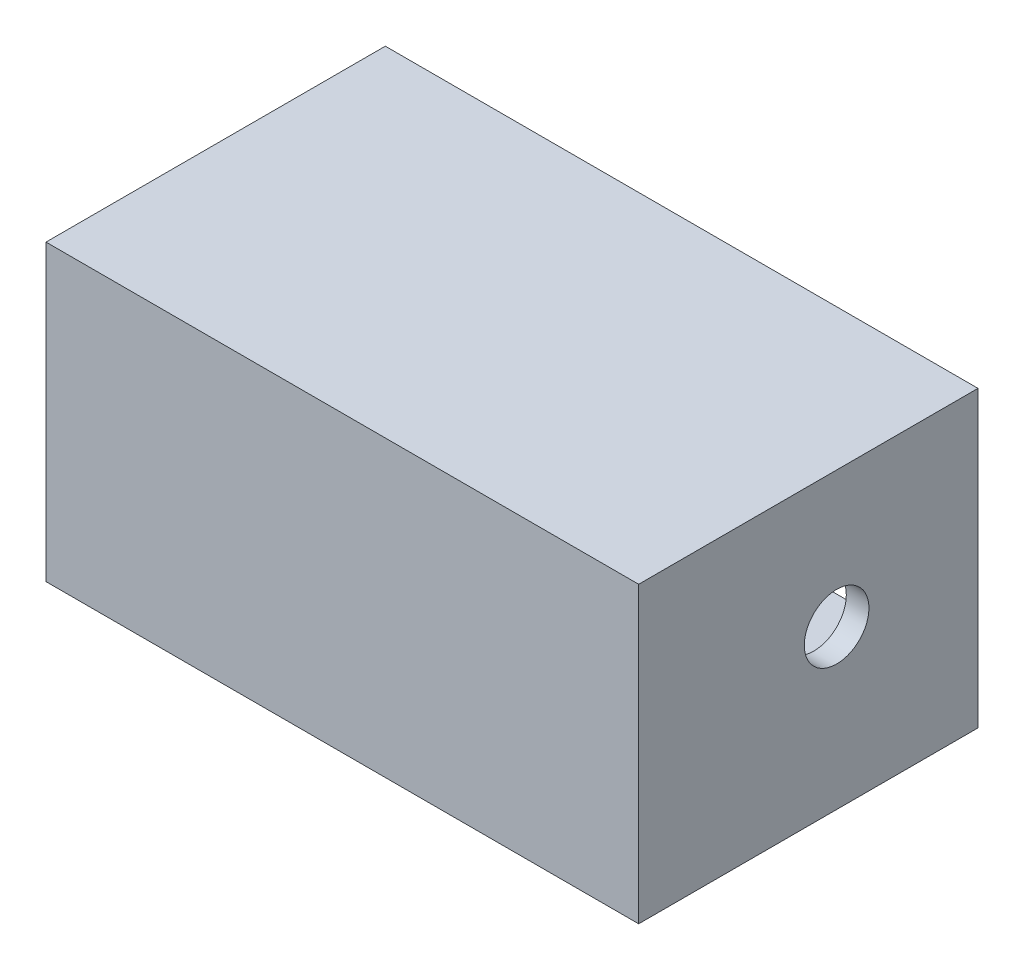
ISO-10303-21;
HEADER;
FILE_DESCRIPTION(('STEP AP214'),'2;1');
FILE_NAME('part.step','',(''),(''),'','','');
FILE_SCHEMA(('AUTOMOTIVE_DESIGN { 1 0 10303 214 1 1 1 1 }'));
ENDSEC;
DATA;
#1=APPLICATION_CONTEXT('core data for automotive mechanical design processes');
#2=APPLICATION_PROTOCOL_DEFINITION('international standard','automotive_design',2000,#1);
#3=PRODUCT_CONTEXT('',#1,'mechanical');
#4=PRODUCT('Part','Part','',(#3));
#5=PRODUCT_RELATED_PRODUCT_CATEGORY('part','',(#4));
#6=PRODUCT_DEFINITION_FORMATION('','',#4);
#7=PRODUCT_DEFINITION_CONTEXT('part definition',#1,'design');
#8=PRODUCT_DEFINITION('design','',#6,#7);
#9=PRODUCT_DEFINITION_SHAPE('','',#8);
#10=(LENGTH_UNIT() NAMED_UNIT(*) SI_UNIT(.MILLI.,.METRE.));
#11=(NAMED_UNIT(*) PLANE_ANGLE_UNIT() SI_UNIT($,.RADIAN.));
#12=(NAMED_UNIT(*) SI_UNIT($,.STERADIAN.) SOLID_ANGLE_UNIT());
#13=UNCERTAINTY_MEASURE_WITH_UNIT(LENGTH_MEASURE(1.E-05),#10,'distance_accuracy_value','');
#14=(GEOMETRIC_REPRESENTATION_CONTEXT(3) GLOBAL_UNCERTAINTY_ASSIGNED_CONTEXT((#13)) GLOBAL_UNIT_ASSIGNED_CONTEXT((#10,
#11,#12)) REPRESENTATION_CONTEXT('',''));
#15=CARTESIAN_POINT('',(0.,0.,0.));
#16=DIRECTION('',(0.,0.,1.));
#17=DIRECTION('',(1.,0.,0.));
#18=AXIS2_PLACEMENT_3D('',#15,#16,#17);
#19=CARTESIAN_POINT('',(0.,20.,0.));
#20=DIRECTION('',(0.,-1.,0.));
#21=DIRECTION('',(0.,0.,-1.));
#22=AXIS2_PLACEMENT_3D('',#19,#20,#21);
#23=PLANE('',#22);
#24=DIRECTION('',(0.,0.,-1.));
#25=VECTOR('',#24,1.);
#26=CARTESIAN_POINT('',(10.,20.,-10.));
#27=LINE('',#26,#25);
#28=CARTESIAN_POINT('',(10.,20.,-10.));
#29=VERTEX_POINT('',#28);
#30=CARTESIAN_POINT('',(10.,20.,-150.));
#31=VERTEX_POINT('',#30);
#32=EDGE_CURVE('E61',#29,#31,#27,.T.);
#33=ORIENTED_EDGE('',*,*,#32,.F.);
#34=DIRECTION('',(-1.,0.,0.));
#35=VECTOR('',#34,1.);
#36=CARTESIAN_POINT('',(10.,20.,-10.));
#37=LINE('',#36,#35);
#38=CARTESIAN_POINT('',(252.,20.,-10.));
#39=VERTEX_POINT('',#38);
#40=EDGE_CURVE('E174',#39,#29,#37,.T.);
#41=ORIENTED_EDGE('',*,*,#40,.F.);
#42=DIRECTION('',(0.,0.,1.));
#43=VECTOR('',#42,1.);
#44=CARTESIAN_POINT('',(252.,20.,-150.));
#45=LINE('',#44,#43);
#46=CARTESIAN_POINT('',(252.,20.,-150.));
#47=VERTEX_POINT('',#46);
#48=EDGE_CURVE('E154',#47,#39,#45,.T.);
#49=ORIENTED_EDGE('',*,*,#48,.F.);
#50=DIRECTION('',(-1.,0.,0.));
#51=VECTOR('',#50,1.);
#52=CARTESIAN_POINT('',(0.,20.,-150.));
#53=LINE('',#52,#51);
#54=EDGE_CURVE('E66',#47,#31,#53,.T.);
#55=ORIENTED_EDGE('',*,*,#54,.T.);
#56=EDGE_LOOP('',(#33,#41,#49,#55));
#57=FACE_BOUND('',#56,.T.);
#58=ADVANCED_FACE('F45',(#57),#23,.F.);
#59=CARTESIAN_POINT('',(0.,20.,0.));
#60=DIRECTION('',(1.,0.,0.));
#61=DIRECTION('',(0.,0.,-1.));
#62=AXIS2_PLACEMENT_3D('',#59,#60,#61);
#63=PLANE('',#62);
#64=CARTESIAN_POINT('',(0.,70.,-87.5));
#65=DIRECTION('',(1.,0.,0.));
#66=DIRECTION('',(0.,0.,-1.));
#67=AXIS2_PLACEMENT_3D('',#64,#65,#66);
#68=CIRCLE('',#67,14.2875);
#69=CARTESIAN_POINT('',(0.,70.,-101.7875));
#70=VERTEX_POINT('',#69);
#71=EDGE_CURVE('E150',#70,#70,#68,.T.);
#72=ORIENTED_EDGE('',*,*,#71,.T.);
#73=EDGE_LOOP('',(#72));
#74=FACE_BOUND('',#73,.T.);
#75=DIRECTION('',(0.,0.,1.));
#76=VECTOR('',#75,1.);
#77=CARTESIAN_POINT('',(0.,0.,0.));
#78=LINE('',#77,#76);
#79=CARTESIAN_POINT('',(0.,0.,-150.));
#80=VERTEX_POINT('',#79);
#81=CARTESIAN_POINT('',(0.,0.,0.));
#82=VERTEX_POINT('',#81);
#83=EDGE_CURVE('E114',#80,#82,#78,.T.);
#84=ORIENTED_EDGE('',*,*,#83,.T.);
#85=DIRECTION('',(0.,-1.,0.));
#86=VECTOR('',#85,1.);
#87=CARTESIAN_POINT('',(0.,20.,0.));
#88=LINE('',#87,#86);
#89=CARTESIAN_POINT('',(0.,130.,0.));
#90=VERTEX_POINT('',#89);
#91=EDGE_CURVE('E11',#90,#82,#88,.T.);
#92=ORIENTED_EDGE('',*,*,#91,.F.);
#93=DIRECTION('',(0.,0.,1.));
#94=VECTOR('',#93,1.);
#95=CARTESIAN_POINT('',(0.,130.,0.));
#96=LINE('',#95,#94);
#97=CARTESIAN_POINT('',(0.,130.,-150.));
#98=VERTEX_POINT('',#97);
#99=EDGE_CURVE('E112',#98,#90,#96,.T.);
#100=ORIENTED_EDGE('',*,*,#99,.F.);
#101=DIRECTION('',(0.,-1.,0.));
#102=VECTOR('',#101,1.);
#103=CARTESIAN_POINT('',(0.,20.,-150.));
#104=LINE('',#103,#102);
#105=EDGE_CURVE('E196',#98,#80,#104,.T.);
#106=ORIENTED_EDGE('',*,*,#105,.T.);
#107=EDGE_LOOP('',(#84,#92,#100,#106));
#108=FACE_BOUND('',#107,.T.);
#109=ADVANCED_FACE('F47',(#74,#108),#63,.F.);
#110=CARTESIAN_POINT('',(0.,20.,0.));
#111=DIRECTION('',(0.,0.,-1.));
#112=DIRECTION('',(-1.,0.,0.));
#113=AXIS2_PLACEMENT_3D('',#110,#111,#112);
#114=PLANE('',#113);
#115=DIRECTION('',(1.,0.,0.));
#116=VECTOR('',#115,1.);
#117=CARTESIAN_POINT('',(0.,0.,0.));
#118=LINE('',#117,#116);
#119=CARTESIAN_POINT('',(262.,0.,0.));
#120=VERTEX_POINT('',#119);
#121=EDGE_CURVE('E200',#82,#120,#118,.T.);
#122=ORIENTED_EDGE('',*,*,#121,.T.);
#123=DIRECTION('',(0.,-1.,0.));
#124=VECTOR('',#123,1.);
#125=CARTESIAN_POINT('',(262.,20.,0.));
#126=LINE('',#125,#124);
#127=CARTESIAN_POINT('',(262.,130.,0.));
#128=VERTEX_POINT('',#127);
#129=EDGE_CURVE('E54',#128,#120,#126,.T.);
#130=ORIENTED_EDGE('',*,*,#129,.F.);
#131=DIRECTION('',(1.,0.,0.));
#132=VECTOR('',#131,1.);
#133=CARTESIAN_POINT('',(0.,130.,0.));
#134=LINE('',#133,#132);
#135=EDGE_CURVE('E117',#90,#128,#134,.T.);
#136=ORIENTED_EDGE('',*,*,#135,.F.);
#137=ORIENTED_EDGE('',*,*,#91,.T.);
#138=EDGE_LOOP('',(#122,#130,#136,#137));
#139=FACE_BOUND('',#138,.T.);
#140=ADVANCED_FACE('F118',(#139),#114,.F.);
#141=CARTESIAN_POINT('',(262.,20.,0.));
#142=DIRECTION('',(-1.,0.,0.));
#143=DIRECTION('',(0.,0.,1.));
#144=AXIS2_PLACEMENT_3D('',#141,#142,#143);
#145=PLANE('',#144);
#146=CARTESIAN_POINT('',(262.,70.,-87.5));
#147=DIRECTION('',(1.,0.,0.));
#148=DIRECTION('',(0.,0.,-1.));
#149=AXIS2_PLACEMENT_3D('',#146,#147,#148);
#150=CIRCLE('',#149,14.2875);
#151=CARTESIAN_POINT('',(262.,70.,-101.7875));
#152=VERTEX_POINT('',#151);
#153=EDGE_CURVE('E142',#152,#152,#150,.T.);
#154=ORIENTED_EDGE('',*,*,#153,.F.);
#155=EDGE_LOOP('',(#154));
#156=FACE_BOUND('',#155,.T.);
#157=DIRECTION('',(0.,0.,-1.));
#158=VECTOR('',#157,1.);
#159=CARTESIAN_POINT('',(262.,0.,0.));
#160=LINE('',#159,#158);
#161=CARTESIAN_POINT('',(262.,0.,-150.));
#162=VERTEX_POINT('',#161);
#163=EDGE_CURVE('E203',#120,#162,#160,.T.);
#164=ORIENTED_EDGE('',*,*,#163,.T.);
#165=DIRECTION('',(0.,-1.,0.));
#166=VECTOR('',#165,1.);
#167=CARTESIAN_POINT('',(262.,20.,-150.));
#168=LINE('',#167,#166);
#169=CARTESIAN_POINT('',(262.,130.,-150.));
#170=VERTEX_POINT('',#169);
#171=EDGE_CURVE('E210',#170,#162,#168,.T.);
#172=ORIENTED_EDGE('',*,*,#171,.F.);
#173=DIRECTION('',(0.,0.,-1.));
#174=VECTOR('',#173,1.);
#175=CARTESIAN_POINT('',(262.,130.,0.));
#176=LINE('',#175,#174);
#177=EDGE_CURVE('E124',#128,#170,#176,.T.);
#178=ORIENTED_EDGE('',*,*,#177,.F.);
#179=ORIENTED_EDGE('',*,*,#129,.T.);
#180=EDGE_LOOP('',(#164,#172,#178,#179));
#181=FACE_BOUND('',#180,.T.);
#182=ADVANCED_FACE('F216',(#156,#181),#145,.F.);
#183=CARTESIAN_POINT('',(0.,20.,-150.));
#184=DIRECTION('',(0.,0.,1.));
#185=DIRECTION('',(1.,0.,0.));
#186=AXIS2_PLACEMENT_3D('',#183,#184,#185);
#187=PLANE('',#186);
#188=DIRECTION('',(0.,-1.,0.));
#189=VECTOR('',#188,1.);
#190=CARTESIAN_POINT('',(252.,120.,-150.));
#191=LINE('',#190,#189);
#192=CARTESIAN_POINT('',(252.,120.,-150.));
#193=VERTEX_POINT('',#192);
#194=EDGE_CURVE('E190',#193,#47,#191,.T.);
#195=ORIENTED_EDGE('',*,*,#194,.F.);
#196=DIRECTION('',(-1.,0.,0.));
#197=VECTOR('',#196,1.);
#198=CARTESIAN_POINT('',(0.,120.,-150.));
#199=LINE('',#198,#197);
#200=CARTESIAN_POINT('',(10.,120.,-150.));
#201=VERTEX_POINT('',#200);
#202=EDGE_CURVE('E131',#193,#201,#199,.T.);
#203=ORIENTED_EDGE('',*,*,#202,.T.);
#204=DIRECTION('',(0.,-1.,0.));
#205=VECTOR('',#204,1.);
#206=CARTESIAN_POINT('',(10.,120.,-150.));
#207=LINE('',#206,#205);
#208=EDGE_CURVE('E170',#201,#31,#207,.T.);
#209=ORIENTED_EDGE('',*,*,#208,.T.);
#210=ORIENTED_EDGE('',*,*,#54,.F.);
#211=EDGE_LOOP('',(#195,#203,#209,#210));
#212=FACE_BOUND('',#211,.T.);
#213=DIRECTION('',(-1.,0.,0.));
#214=VECTOR('',#213,1.);
#215=CARTESIAN_POINT('',(0.,0.,-150.));
#216=LINE('',#215,#214);
#217=EDGE_CURVE('E197',#162,#80,#216,.T.);
#218=ORIENTED_EDGE('',*,*,#217,.T.);
#219=ORIENTED_EDGE('',*,*,#105,.F.);
#220=DIRECTION('',(-1.,0.,0.));
#221=VECTOR('',#220,1.);
#222=CARTESIAN_POINT('',(0.,130.,-150.));
#223=LINE('',#222,#221);
#224=EDGE_CURVE('E129',#170,#98,#223,.T.);
#225=ORIENTED_EDGE('',*,*,#224,.F.);
#226=ORIENTED_EDGE('',*,*,#171,.T.);
#227=EDGE_LOOP('',(#218,#219,#225,#226));
#228=FACE_BOUND('',#227,.T.);
#229=ADVANCED_FACE('F221',(#212,#228),#187,.F.);
#230=CARTESIAN_POINT('',(0.,0.,0.));
#231=DIRECTION('',(0.,-1.,0.));
#232=DIRECTION('',(0.,0.,-1.));
#233=AXIS2_PLACEMENT_3D('',#230,#231,#232);
#234=PLANE('',#233);
#235=ORIENTED_EDGE('',*,*,#83,.F.);
#236=ORIENTED_EDGE('',*,*,#217,.F.);
#237=ORIENTED_EDGE('',*,*,#163,.F.);
#238=ORIENTED_EDGE('',*,*,#121,.F.);
#239=EDGE_LOOP('',(#235,#236,#237,#238));
#240=FACE_BOUND('',#239,.T.);
#241=ADVANCED_FACE('F219',(#240),#234,.T.);
#242=CARTESIAN_POINT('',(252.,120.,-150.));
#243=DIRECTION('',(1.,0.,0.));
#244=DIRECTION('',(0.,0.,-1.));
#245=AXIS2_PLACEMENT_3D('',#242,#243,#244);
#246=PLANE('',#245);
#247=CARTESIAN_POINT('',(252.,70.,-87.5));
#248=DIRECTION('',(1.,0.,0.));
#249=DIRECTION('',(0.,0.,-1.));
#250=AXIS2_PLACEMENT_3D('',#247,#248,#249);
#251=CIRCLE('',#250,14.2875);
#252=CARTESIAN_POINT('',(252.,70.,-101.7875));
#253=VERTEX_POINT('',#252);
#254=EDGE_CURVE('E140',#253,#253,#251,.T.);
#255=ORIENTED_EDGE('',*,*,#254,.T.);
#256=EDGE_LOOP('',(#255));
#257=FACE_BOUND('',#256,.T.);
#258=ORIENTED_EDGE('',*,*,#48,.T.);
#259=DIRECTION('',(0.,-1.,0.));
#260=VECTOR('',#259,1.);
#261=CARTESIAN_POINT('',(252.,120.,-10.));
#262=LINE('',#261,#260);
#263=CARTESIAN_POINT('',(252.,120.,-10.));
#264=VERTEX_POINT('',#263);
#265=EDGE_CURVE('E186',#264,#39,#262,.T.);
#266=ORIENTED_EDGE('',*,*,#265,.F.);
#267=DIRECTION('',(0.,0.,1.));
#268=VECTOR('',#267,1.);
#269=CARTESIAN_POINT('',(252.,120.,-150.));
#270=LINE('',#269,#268);
#271=EDGE_CURVE('E158',#193,#264,#270,.T.);
#272=ORIENTED_EDGE('',*,*,#271,.F.);
#273=ORIENTED_EDGE('',*,*,#194,.T.);
#274=EDGE_LOOP('',(#258,#266,#272,#273));
#275=FACE_BOUND('',#274,.T.);
#276=ADVANCED_FACE('F230',(#257,#275),#246,.F.);
#277=CARTESIAN_POINT('',(10.,120.,-10.));
#278=DIRECTION('',(0.,0.,1.));
#279=DIRECTION('',(1.,0.,0.));
#280=AXIS2_PLACEMENT_3D('',#277,#278,#279);
#281=PLANE('',#280);
#282=ORIENTED_EDGE('',*,*,#40,.T.);
#283=DIRECTION('',(0.,-1.,0.));
#284=VECTOR('',#283,1.);
#285=CARTESIAN_POINT('',(10.,120.,-10.));
#286=LINE('',#285,#284);
#287=CARTESIAN_POINT('',(10.,120.,-10.));
#288=VERTEX_POINT('',#287);
#289=EDGE_CURVE('E182',#288,#29,#286,.T.);
#290=ORIENTED_EDGE('',*,*,#289,.F.);
#291=DIRECTION('',(-1.,0.,0.));
#292=VECTOR('',#291,1.);
#293=CARTESIAN_POINT('',(10.,120.,-10.));
#294=LINE('',#293,#292);
#295=EDGE_CURVE('E162',#264,#288,#294,.T.);
#296=ORIENTED_EDGE('',*,*,#295,.F.);
#297=ORIENTED_EDGE('',*,*,#265,.T.);
#298=EDGE_LOOP('',(#282,#290,#296,#297));
#299=FACE_BOUND('',#298,.T.);
#300=ADVANCED_FACE('F243',(#299),#281,.F.);
#301=CARTESIAN_POINT('',(10.,120.,-10.));
#302=DIRECTION('',(-1.,0.,0.));
#303=DIRECTION('',(0.,0.,1.));
#304=AXIS2_PLACEMENT_3D('',#301,#302,#303);
#305=PLANE('',#304);
#306=CARTESIAN_POINT('',(10.,70.,-87.5));
#307=DIRECTION('',(1.,0.,0.));
#308=DIRECTION('',(0.,0.,-1.));
#309=AXIS2_PLACEMENT_3D('',#306,#307,#308);
#310=CIRCLE('',#309,14.2875);
#311=CARTESIAN_POINT('',(10.,70.,-101.7875));
#312=VERTEX_POINT('',#311);
#313=EDGE_CURVE('E146',#312,#312,#310,.T.);
#314=ORIENTED_EDGE('',*,*,#313,.F.);
#315=EDGE_LOOP('',(#314));
#316=FACE_BOUND('',#315,.T.);
#317=ORIENTED_EDGE('',*,*,#32,.T.);
#318=ORIENTED_EDGE('',*,*,#208,.F.);
#319=DIRECTION('',(0.,0.,-1.));
#320=VECTOR('',#319,1.);
#321=CARTESIAN_POINT('',(10.,120.,-10.));
#322=LINE('',#321,#320);
#323=EDGE_CURVE('E166',#288,#201,#322,.T.);
#324=ORIENTED_EDGE('',*,*,#323,.F.);
#325=ORIENTED_EDGE('',*,*,#289,.T.);
#326=EDGE_LOOP('',(#317,#318,#324,#325));
#327=FACE_BOUND('',#326,.T.);
#328=ADVANCED_FACE('F247',(#316,#327),#305,.F.);
#329=CARTESIAN_POINT('',(0.,70.,-87.5));
#330=DIRECTION('',(1.,0.,0.));
#331=DIRECTION('',(0.,0.,-1.));
#332=AXIS2_PLACEMENT_3D('',#329,#330,#331);
#333=CYLINDRICAL_SURFACE('',#332,14.2875);
#334=ORIENTED_EDGE('',*,*,#71,.F.);
#335=EDGE_LOOP('',(#334));
#336=FACE_BOUND('',#335,.T.);
#337=ORIENTED_EDGE('',*,*,#313,.T.);
#338=EDGE_LOOP('',(#337));
#339=FACE_BOUND('',#338,.T.);
#340=ADVANCED_FACE('F251',(#336,#339),#333,.F.);
#341=CARTESIAN_POINT('',(262.,70.,-87.5));
#342=DIRECTION('',(-1.,0.,0.));
#343=DIRECTION('',(0.,0.,1.));
#344=AXIS2_PLACEMENT_3D('',#341,#342,#343);
#345=CYLINDRICAL_SURFACE('',#344,14.2875);
#346=ORIENTED_EDGE('',*,*,#153,.T.);
#347=EDGE_LOOP('',(#346));
#348=FACE_BOUND('',#347,.T.);
#349=ORIENTED_EDGE('',*,*,#254,.F.);
#350=EDGE_LOOP('',(#349));
#351=FACE_BOUND('',#350,.T.);
#352=ADVANCED_FACE('F254',(#348,#351),#345,.F.);
#353=CARTESIAN_POINT('',(0.,130.,0.));
#354=DIRECTION('',(0.,-1.,0.));
#355=DIRECTION('',(0.,0.,-1.));
#356=AXIS2_PLACEMENT_3D('',#353,#354,#355);
#357=PLANE('',#356);
#358=ORIENTED_EDGE('',*,*,#99,.T.);
#359=ORIENTED_EDGE('',*,*,#135,.T.);
#360=ORIENTED_EDGE('',*,*,#177,.T.);
#361=ORIENTED_EDGE('',*,*,#224,.T.);
#362=EDGE_LOOP('',(#358,#359,#360,#361));
#363=FACE_BOUND('',#362,.T.);
#364=ADVANCED_FACE('F127',(#363),#357,.F.);
#365=CARTESIAN_POINT('',(0.,120.,0.));
#366=DIRECTION('',(0.,-1.,0.));
#367=DIRECTION('',(0.,0.,-1.));
#368=AXIS2_PLACEMENT_3D('',#365,#366,#367);
#369=PLANE('',#368);
#370=ORIENTED_EDGE('',*,*,#202,.F.);
#371=ORIENTED_EDGE('',*,*,#271,.T.);
#372=ORIENTED_EDGE('',*,*,#295,.T.);
#373=ORIENTED_EDGE('',*,*,#323,.T.);
#374=EDGE_LOOP('',(#370,#371,#372,#373));
#375=FACE_BOUND('',#374,.T.);
#376=ADVANCED_FACE('F259',(#375),#369,.T.);
#377=CLOSED_SHELL('',(#58,#109,#140,#182,#229,#241,#276,#300,#328,#340,#352,#364,#376));
#378=MANIFOLD_SOLID_BREP('B2',#377);
#379=ADVANCED_BREP_SHAPE_REPRESENTATION('',(#18,#378),#14);
#380=SHAPE_DEFINITION_REPRESENTATION(#9,#379);
ENDSEC;
END-ISO-10303-21;
